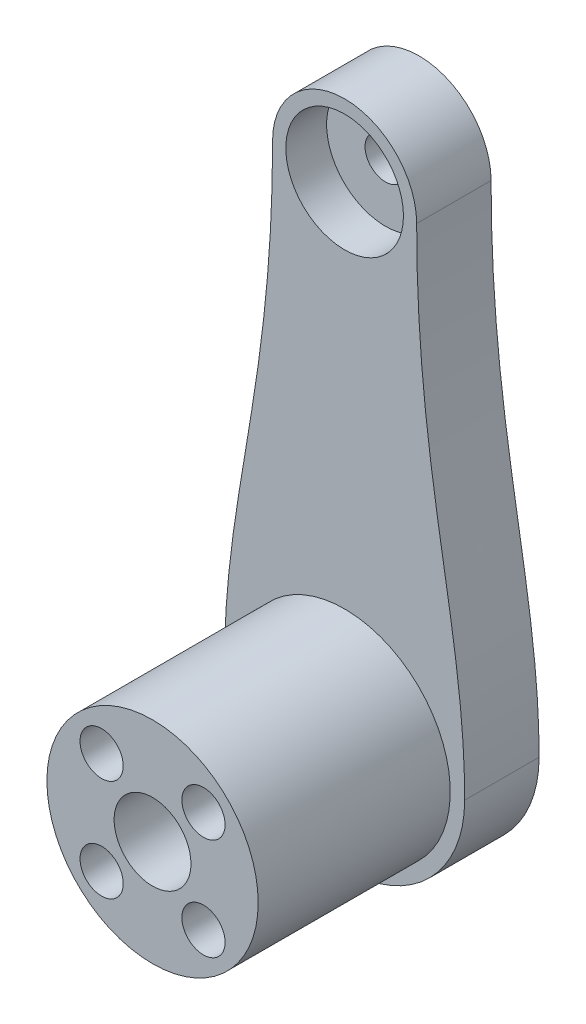
ISO-10303-21;
HEADER;
FILE_DESCRIPTION(('STEP AP214'),'2;1');
FILE_NAME('part.step','',(''),(''),'','','');
FILE_SCHEMA(('AUTOMOTIVE_DESIGN { 1 0 10303 214 1 1 1 1 }'));
ENDSEC;
DATA;
#1=APPLICATION_CONTEXT('core data for automotive mechanical design processes');
#2=APPLICATION_PROTOCOL_DEFINITION('international standard','automotive_design',2000,#1);
#3=PRODUCT_CONTEXT('',#1,'mechanical');
#4=PRODUCT('Part','Part','',(#3));
#5=PRODUCT_RELATED_PRODUCT_CATEGORY('part','',(#4));
#6=PRODUCT_DEFINITION_FORMATION('','',#4);
#7=PRODUCT_DEFINITION_CONTEXT('part definition',#1,'design');
#8=PRODUCT_DEFINITION('design','',#6,#7);
#9=PRODUCT_DEFINITION_SHAPE('','',#8);
#10=(LENGTH_UNIT() NAMED_UNIT(*) SI_UNIT(.MILLI.,.METRE.));
#11=(NAMED_UNIT(*) PLANE_ANGLE_UNIT() SI_UNIT($,.RADIAN.));
#12=(NAMED_UNIT(*) SI_UNIT($,.STERADIAN.) SOLID_ANGLE_UNIT());
#13=UNCERTAINTY_MEASURE_WITH_UNIT(LENGTH_MEASURE(1.E-05),#10,'distance_accuracy_value','');
#14=(GEOMETRIC_REPRESENTATION_CONTEXT(3) GLOBAL_UNCERTAINTY_ASSIGNED_CONTEXT((#13)) GLOBAL_UNIT_ASSIGNED_CONTEXT((#10,
#11,#12)) REPRESENTATION_CONTEXT('',''));
#15=CARTESIAN_POINT('',(0.,0.,0.));
#16=DIRECTION('',(0.,0.,1.));
#17=DIRECTION('',(1.,0.,0.));
#18=AXIS2_PLACEMENT_3D('',#15,#16,#17);
#19=CARTESIAN_POINT('',(0.,0.,27.75));
#20=DIRECTION('',(0.,0.,-1.));
#21=DIRECTION('',(-1.,0.,0.));
#22=AXIS2_PLACEMENT_3D('',#19,#20,#21);
#23=CYLINDRICAL_SURFACE('',#22,2.125);
#24=CARTESIAN_POINT('',(0.,0.,17.75));
#25=DIRECTION('',(0.,0.,1.));
#26=DIRECTION('',(1.,0.,0.));
#27=AXIS2_PLACEMENT_3D('',#24,#25,#26);
#28=CIRCLE('',#27,2.125);
#29=CARTESIAN_POINT('',(2.125,0.,17.75));
#30=VERTEX_POINT('',#29);
#31=EDGE_CURVE('E234',#30,#30,#28,.T.);
#32=ORIENTED_EDGE('',*,*,#31,.T.);
#33=EDGE_LOOP('',(#32));
#34=FACE_BOUND('',#33,.T.);
#35=CARTESIAN_POINT('',(0.,0.,6.));
#36=DIRECTION('',(0.,0.,-1.));
#37=DIRECTION('',(-1.,0.,0.));
#38=AXIS2_PLACEMENT_3D('',#35,#36,#37);
#39=CIRCLE('',#38,2.125);
#40=CARTESIAN_POINT('',(-2.125,0.,6.));
#41=VERTEX_POINT('',#40);
#42=EDGE_CURVE('E40',#41,#41,#39,.F.);
#43=ORIENTED_EDGE('',*,*,#42,.F.);
#44=EDGE_LOOP('',(#43));
#45=FACE_BOUND('',#44,.T.);
#46=ADVANCED_FACE('F35',(#34,#45),#23,.F.);
#47=CARTESIAN_POINT('',(7.5,49.5,7.75));
#48=CARTESIAN_POINT('',(7.5,26.668276539157,7.75));
#49=CARTESIAN_POINT('',(12.5,15.6314619090427,7.75));
#50=CARTESIAN_POINT('',(12.5,0.,7.75));
#51=B_SPLINE_CURVE_WITH_KNOTS('',3,(#47,#48,#49,#50),.UNSPECIFIED.,.F.,.F.,(4,4),(0.,1.),.UNSPECIFIED.);
#52=DIRECTION('',(0.,0.,-1.));
#53=VECTOR('',#52,1.);
#54=SURFACE_OF_LINEAR_EXTRUSION('',#51,#53);
#55=CARTESIAN_POINT('',(7.5,49.5,0.));
#56=CARTESIAN_POINT('',(7.5,26.668276539157,0.));
#57=CARTESIAN_POINT('',(12.5,15.6314619090427,0.));
#58=CARTESIAN_POINT('',(12.5,0.,0.));
#59=B_SPLINE_CURVE_WITH_KNOTS('',3,(#55,#56,#57,#58),.UNSPECIFIED.,.F.,.F.,(4,4),(0.,1.),.UNSPECIFIED.);
#60=CARTESIAN_POINT('',(7.5,49.5,0.));
#61=VERTEX_POINT('',#60);
#62=CARTESIAN_POINT('',(12.5,0.,0.));
#63=VERTEX_POINT('',#62);
#64=EDGE_CURVE('E212',#61,#63,#59,.T.);
#65=ORIENTED_EDGE('',*,*,#64,.F.);
#66=DIRECTION('',(0.,0.,-1.));
#67=VECTOR('',#66,1.);
#68=CARTESIAN_POINT('',(7.5,49.5,7.75));
#69=LINE('',#68,#67);
#70=CARTESIAN_POINT('',(7.5,49.5,7.75));
#71=VERTEX_POINT('',#70);
#72=EDGE_CURVE('E46',#71,#61,#69,.T.);
#73=ORIENTED_EDGE('',*,*,#72,.F.);
#74=CARTESIAN_POINT('',(12.5,0.,7.75));
#75=VERTEX_POINT('',#74);
#76=EDGE_CURVE('E101',#71,#75,#51,.T.);
#77=ORIENTED_EDGE('',*,*,#76,.T.);
#78=DIRECTION('',(0.,0.,-1.));
#79=VECTOR('',#78,1.);
#80=CARTESIAN_POINT('',(12.5,0.,7.75));
#81=LINE('',#80,#79);
#82=EDGE_CURVE('E98',#75,#63,#81,.T.);
#83=ORIENTED_EDGE('',*,*,#82,.T.);
#84=EDGE_LOOP('',(#65,#73,#77,#83));
#85=FACE_BOUND('',#84,.T.);
#86=ADVANCED_FACE('F37',(#85),#54,.T.);
#87=CARTESIAN_POINT('',(0.,49.5,7.75));
#88=DIRECTION('',(0.,0.,-1.));
#89=DIRECTION('',(-1.,0.,0.));
#90=AXIS2_PLACEMENT_3D('',#87,#88,#89);
#91=CYLINDRICAL_SURFACE('',#90,7.5);
#92=CARTESIAN_POINT('',(0.,49.5,0.));
#93=DIRECTION('',(0.,0.,1.));
#94=DIRECTION('',(1.,0.,0.));
#95=AXIS2_PLACEMENT_3D('',#92,#93,#94);
#96=CIRCLE('',#95,7.5);
#97=CARTESIAN_POINT('',(-7.5,49.5,0.));
#98=VERTEX_POINT('',#97);
#99=EDGE_CURVE('E71',#61,#98,#96,.T.);
#100=ORIENTED_EDGE('',*,*,#99,.T.);
#101=DIRECTION('',(0.,0.,-1.));
#102=VECTOR('',#101,1.);
#103=CARTESIAN_POINT('',(-7.5,49.5,7.75));
#104=LINE('',#103,#102);
#105=CARTESIAN_POINT('',(-7.5,49.5,7.75));
#106=VERTEX_POINT('',#105);
#107=EDGE_CURVE('E97',#106,#98,#104,.T.);
#108=ORIENTED_EDGE('',*,*,#107,.F.);
#109=CARTESIAN_POINT('',(0.,49.5,7.75));
#110=DIRECTION('',(0.,0.,1.));
#111=DIRECTION('',(1.,0.,0.));
#112=AXIS2_PLACEMENT_3D('',#109,#110,#111);
#113=CIRCLE('',#112,7.5);
#114=EDGE_CURVE('E86',#71,#106,#113,.T.);
#115=ORIENTED_EDGE('',*,*,#114,.F.);
#116=ORIENTED_EDGE('',*,*,#72,.T.);
#117=EDGE_LOOP('',(#100,#108,#115,#116));
#118=FACE_BOUND('',#117,.T.);
#119=ADVANCED_FACE('F118',(#118),#91,.T.);
#120=CARTESIAN_POINT('',(-7.5,49.5,7.75));
#121=CARTESIAN_POINT('',(-7.5,26.668276539157,7.75));
#122=CARTESIAN_POINT('',(-12.5,15.6314619090427,7.75));
#123=CARTESIAN_POINT('',(-12.5,0.,7.75));
#124=B_SPLINE_CURVE_WITH_KNOTS('',3,(#120,#121,#122,#123),.UNSPECIFIED.,.F.,.F.,(4,4),(0.,1.),.UNSPECIFIED.);
#125=DIRECTION('',(0.,0.,-1.));
#126=VECTOR('',#125,1.);
#127=SURFACE_OF_LINEAR_EXTRUSION('',#124,#126);
#128=CARTESIAN_POINT('',(-7.5,49.5,0.));
#129=CARTESIAN_POINT('',(-7.5,26.668276539157,0.));
#130=CARTESIAN_POINT('',(-12.5,15.6314619090427,0.));
#131=CARTESIAN_POINT('',(-12.5,0.,0.));
#132=B_SPLINE_CURVE_WITH_KNOTS('',3,(#128,#129,#130,#131),.UNSPECIFIED.,.F.,.F.,(4,4),(0.,1.),.UNSPECIFIED.);
#133=CARTESIAN_POINT('',(-12.5,0.,0.));
#134=VERTEX_POINT('',#133);
#135=EDGE_CURVE('E93',#98,#134,#132,.T.);
#136=ORIENTED_EDGE('',*,*,#135,.T.);
#137=DIRECTION('',(0.,0.,-1.));
#138=VECTOR('',#137,1.);
#139=CARTESIAN_POINT('',(-12.5,0.,7.75));
#140=LINE('',#139,#138);
#141=CARTESIAN_POINT('',(-12.5,0.,7.75));
#142=VERTEX_POINT('',#141);
#143=EDGE_CURVE('E90',#142,#134,#140,.T.);
#144=ORIENTED_EDGE('',*,*,#143,.F.);
#145=EDGE_CURVE('E83',#106,#142,#124,.T.);
#146=ORIENTED_EDGE('',*,*,#145,.F.);
#147=ORIENTED_EDGE('',*,*,#107,.T.);
#148=EDGE_LOOP('',(#136,#144,#146,#147));
#149=FACE_BOUND('',#148,.T.);
#150=ADVANCED_FACE('F91',(#149),#127,.F.);
#151=CARTESIAN_POINT('',(0.,0.,7.75));
#152=DIRECTION('',(0.,0.,-1.));
#153=DIRECTION('',(-1.,0.,0.));
#154=AXIS2_PLACEMENT_3D('',#151,#152,#153);
#155=CYLINDRICAL_SURFACE('',#154,12.5);
#156=CARTESIAN_POINT('',(0.,0.,0.));
#157=DIRECTION('',(0.,0.,1.));
#158=DIRECTION('',(1.,0.,0.));
#159=AXIS2_PLACEMENT_3D('',#156,#157,#158);
#160=CIRCLE('',#159,12.5);
#161=EDGE_CURVE('E213',#134,#63,#160,.T.);
#162=ORIENTED_EDGE('',*,*,#161,.T.);
#163=ORIENTED_EDGE('',*,*,#82,.F.);
#164=CARTESIAN_POINT('',(0.,0.,7.75));
#165=DIRECTION('',(0.,0.,1.));
#166=DIRECTION('',(1.,0.,0.));
#167=AXIS2_PLACEMENT_3D('',#164,#165,#166);
#168=CIRCLE('',#167,12.5);
#169=EDGE_CURVE('E80',#142,#75,#168,.T.);
#170=ORIENTED_EDGE('',*,*,#169,.F.);
#171=ORIENTED_EDGE('',*,*,#143,.T.);
#172=EDGE_LOOP('',(#162,#163,#170,#171));
#173=FACE_BOUND('',#172,.T.);
#174=ADVANCED_FACE('F100',(#173),#155,.T.);
#175=CARTESIAN_POINT('',(10.,22.0499019180749,7.75));
#176=DIRECTION('',(0.,0.,-1.));
#177=DIRECTION('',(-1.,0.,0.));
#178=AXIS2_PLACEMENT_3D('',#175,#176,#177);
#179=PLANE('',#178);
#180=CARTESIAN_POINT('',(0.,0.,7.75));
#181=DIRECTION('',(0.,0.,-1.));
#182=DIRECTION('',(-1.,0.,0.));
#183=AXIS2_PLACEMENT_3D('',#180,#181,#182);
#184=CIRCLE('',#183,11.);
#185=CARTESIAN_POINT('',(-11.,0.,7.75));
#186=VERTEX_POINT('',#185);
#187=EDGE_CURVE('E11',#186,#186,#184,.F.);
#188=ORIENTED_EDGE('',*,*,#187,.F.);
#189=EDGE_LOOP('',(#188));
#190=FACE_BOUND('',#189,.T.);
#191=CARTESIAN_POINT('',(0.,49.5,7.75));
#192=DIRECTION('',(0.,0.,1.));
#193=DIRECTION('',(1.,0.,0.));
#194=AXIS2_PLACEMENT_3D('',#191,#192,#193);
#195=CIRCLE('',#194,6.125);
#196=CARTESIAN_POINT('',(6.125,49.5,7.75));
#197=VERTEX_POINT('',#196);
#198=EDGE_CURVE('E217',#197,#197,#195,.T.);
#199=ORIENTED_EDGE('',*,*,#198,.F.);
#200=EDGE_LOOP('',(#199));
#201=FACE_BOUND('',#200,.T.);
#202=ORIENTED_EDGE('',*,*,#76,.F.);
#203=ORIENTED_EDGE('',*,*,#114,.T.);
#204=ORIENTED_EDGE('',*,*,#145,.T.);
#205=ORIENTED_EDGE('',*,*,#169,.T.);
#206=EDGE_LOOP('',(#202,#203,#204,#205));
#207=FACE_BOUND('',#206,.T.);
#208=ADVANCED_FACE('F85',(#190,#201,#207),#179,.F.);
#209=CARTESIAN_POINT('',(10.,22.0499019180749,0.));
#210=DIRECTION('',(0.,0.,-1.));
#211=DIRECTION('',(-1.,0.,0.));
#212=AXIS2_PLACEMENT_3D('',#209,#210,#211);
#213=PLANE('',#212);
#214=CARTESIAN_POINT('',(0.,0.,0.));
#215=DIRECTION('',(0.,0.,-1.));
#216=DIRECTION('',(-1.,0.,0.));
#217=AXIS2_PLACEMENT_3D('',#214,#215,#216);
#218=CIRCLE('',#217,2.75);
#219=CARTESIAN_POINT('',(-2.75,0.,0.));
#220=VERTEX_POINT('',#219);
#221=EDGE_CURVE('E206',#220,#220,#218,.T.);
#222=ORIENTED_EDGE('',*,*,#221,.F.);
#223=EDGE_LOOP('',(#222));
#224=FACE_BOUND('',#223,.T.);
#225=CARTESIAN_POINT('',(0.,49.5,0.));
#226=DIRECTION('',(0.,0.,-1.));
#227=DIRECTION('',(-1.,0.,0.));
#228=AXIS2_PLACEMENT_3D('',#225,#226,#227);
#229=CIRCLE('',#228,2.125);
#230=CARTESIAN_POINT('',(-2.125,49.5,0.));
#231=VERTEX_POINT('',#230);
#232=EDGE_CURVE('E210',#231,#231,#229,.F.);
#233=ORIENTED_EDGE('',*,*,#232,.T.);
#234=EDGE_LOOP('',(#233));
#235=FACE_BOUND('',#234,.T.);
#236=ORIENTED_EDGE('',*,*,#64,.T.);
#237=ORIENTED_EDGE('',*,*,#161,.F.);
#238=ORIENTED_EDGE('',*,*,#135,.F.);
#239=ORIENTED_EDGE('',*,*,#99,.F.);
#240=EDGE_LOOP('',(#236,#237,#238,#239));
#241=FACE_BOUND('',#240,.T.);
#242=ADVANCED_FACE('F124',(#224,#235,#241),#213,.T.);
#243=CARTESIAN_POINT('',(0.,49.5,3.5));
#244=DIRECTION('',(0.,0.,1.));
#245=DIRECTION('',(1.,0.,0.));
#246=AXIS2_PLACEMENT_3D('',#243,#244,#245);
#247=CYLINDRICAL_SURFACE('',#246,6.125);
#248=CARTESIAN_POINT('',(0.,49.5,3.5));
#249=DIRECTION('',(0.,0.,1.));
#250=DIRECTION('',(1.,0.,0.));
#251=AXIS2_PLACEMENT_3D('',#248,#249,#250);
#252=CIRCLE('',#251,6.125);
#253=CARTESIAN_POINT('',(6.125,49.5,3.5));
#254=VERTEX_POINT('',#253);
#255=EDGE_CURVE('E214',#254,#254,#252,.T.);
#256=ORIENTED_EDGE('',*,*,#255,.F.);
#257=EDGE_LOOP('',(#256));
#258=FACE_BOUND('',#257,.T.);
#259=ORIENTED_EDGE('',*,*,#198,.T.);
#260=EDGE_LOOP('',(#259));
#261=FACE_BOUND('',#260,.T.);
#262=ADVANCED_FACE('F195',(#258,#261),#247,.F.);
#263=CARTESIAN_POINT('',(0.,49.5,3.5));
#264=DIRECTION('',(0.,0.,1.));
#265=DIRECTION('',(1.,0.,0.));
#266=AXIS2_PLACEMENT_3D('',#263,#264,#265);
#267=PLANE('',#266);
#268=CARTESIAN_POINT('',(0.,49.5,3.5));
#269=DIRECTION('',(0.,0.,1.));
#270=DIRECTION('',(1.,0.,0.));
#271=AXIS2_PLACEMENT_3D('',#268,#269,#270);
#272=CIRCLE('',#271,2.125);
#273=CARTESIAN_POINT('',(2.125,49.5,3.5));
#274=VERTEX_POINT('',#273);
#275=EDGE_CURVE('E279',#274,#274,#272,.T.);
#276=ORIENTED_EDGE('',*,*,#275,.F.);
#277=EDGE_LOOP('',(#276));
#278=FACE_BOUND('',#277,.T.);
#279=ORIENTED_EDGE('',*,*,#255,.T.);
#280=EDGE_LOOP('',(#279));
#281=FACE_BOUND('',#280,.T.);
#282=ADVANCED_FACE('F191',(#278,#281),#267,.T.);
#283=CARTESIAN_POINT('',(0.,49.5,-0.00100000000000013));
#284=DIRECTION('',(0.,0.,1.));
#285=DIRECTION('',(1.,0.,0.));
#286=AXIS2_PLACEMENT_3D('',#283,#284,#285);
#287=CYLINDRICAL_SURFACE('',#286,2.125);
#288=ORIENTED_EDGE('',*,*,#232,.F.);
#289=EDGE_LOOP('',(#288));
#290=FACE_BOUND('',#289,.T.);
#291=ORIENTED_EDGE('',*,*,#275,.T.);
#292=EDGE_LOOP('',(#291));
#293=FACE_BOUND('',#292,.T.);
#294=ADVANCED_FACE('F187',(#290,#293),#287,.F.);
#295=CARTESIAN_POINT('',(0.,0.,27.75));
#296=DIRECTION('',(0.,0.,-1.));
#297=DIRECTION('',(-1.,0.,0.));
#298=AXIS2_PLACEMENT_3D('',#295,#296,#297);
#299=CYLINDRICAL_SURFACE('',#298,11.);
#300=CARTESIAN_POINT('',(0.,0.,27.75));
#301=DIRECTION('',(0.,0.,1.));
#302=DIRECTION('',(1.,0.,0.));
#303=AXIS2_PLACEMENT_3D('',#300,#301,#302);
#304=CIRCLE('',#303,11.);
#305=CARTESIAN_POINT('',(11.,0.,27.75));
#306=VERTEX_POINT('',#305);
#307=EDGE_CURVE('E274',#306,#306,#304,.T.);
#308=ORIENTED_EDGE('',*,*,#307,.F.);
#309=EDGE_LOOP('',(#308));
#310=FACE_BOUND('',#309,.T.);
#311=ORIENTED_EDGE('',*,*,#187,.T.);
#312=EDGE_LOOP('',(#311));
#313=FACE_BOUND('',#312,.T.);
#314=ADVANCED_FACE('F183',(#310,#313),#299,.T.);
#315=CARTESIAN_POINT('',(0.,0.,27.75));
#316=DIRECTION('',(0.,0.,1.));
#317=DIRECTION('',(1.,0.,0.));
#318=AXIS2_PLACEMENT_3D('',#315,#316,#317);
#319=PLANE('',#318);
#320=CARTESIAN_POINT('',(-5.30330085889911,5.30330085889881,27.75));
#321=DIRECTION('',(0.,0.,1.));
#322=DIRECTION('',(1.,0.,0.));
#323=AXIS2_PLACEMENT_3D('',#320,#321,#322);
#324=CIRCLE('',#323,2.25000000000032);
#325=CARTESIAN_POINT('',(-3.05330085889879,5.30330085889881,27.75));
#326=VERTEX_POINT('',#325);
#327=EDGE_CURVE('E235',#326,#326,#324,.T.);
#328=ORIENTED_EDGE('',*,*,#327,.F.);
#329=EDGE_LOOP('',(#328));
#330=FACE_BOUND('',#329,.T.);
#331=CARTESIAN_POINT('',(-5.30330085889881,-5.3033008588994,27.75));
#332=DIRECTION('',(0.,0.,1.));
#333=DIRECTION('',(1.,0.,0.));
#334=AXIS2_PLACEMENT_3D('',#331,#332,#333);
#335=CIRCLE('',#334,2.25000000000022);
#336=CARTESIAN_POINT('',(-3.05330085889859,-5.3033008588994,27.75));
#337=VERTEX_POINT('',#336);
#338=EDGE_CURVE('E266',#337,#337,#335,.T.);
#339=ORIENTED_EDGE('',*,*,#338,.F.);
#340=EDGE_LOOP('',(#339));
#341=FACE_BOUND('',#340,.T.);
#342=CARTESIAN_POINT('',(5.3033008588994,-5.3033008588991,27.75));
#343=DIRECTION('',(0.,0.,1.));
#344=DIRECTION('',(1.,0.,0.));
#345=AXIS2_PLACEMENT_3D('',#342,#343,#344);
#346=CIRCLE('',#345,2.24999999999993);
#347=CARTESIAN_POINT('',(7.55330085889933,-5.3033008588991,27.75));
#348=VERTEX_POINT('',#347);
#349=EDGE_CURVE('E260',#348,#348,#346,.T.);
#350=ORIENTED_EDGE('',*,*,#349,.F.);
#351=EDGE_LOOP('',(#350));
#352=FACE_BOUND('',#351,.T.);
#353=CARTESIAN_POINT('',(5.30330085889911,5.30330085889911,27.75));
#354=DIRECTION('',(0.,0.,1.));
#355=DIRECTION('',(1.,0.,0.));
#356=AXIS2_PLACEMENT_3D('',#353,#354,#355);
#357=CIRCLE('',#356,2.25);
#358=CARTESIAN_POINT('',(7.5533008588991,5.30330085889911,27.75));
#359=VERTEX_POINT('',#358);
#360=EDGE_CURVE('E254',#359,#359,#357,.T.);
#361=ORIENTED_EDGE('',*,*,#360,.F.);
#362=EDGE_LOOP('',(#361));
#363=FACE_BOUND('',#362,.T.);
#364=CARTESIAN_POINT('',(0.,0.,27.75));
#365=DIRECTION('',(0.,0.,1.));
#366=DIRECTION('',(1.,0.,0.));
#367=AXIS2_PLACEMENT_3D('',#364,#365,#366);
#368=CIRCLE('',#367,4.);
#369=CARTESIAN_POINT('',(4.,0.,27.75));
#370=VERTEX_POINT('',#369);
#371=EDGE_CURVE('E253',#370,#370,#368,.T.);
#372=ORIENTED_EDGE('',*,*,#371,.F.);
#373=EDGE_LOOP('',(#372));
#374=FACE_BOUND('',#373,.T.);
#375=ORIENTED_EDGE('',*,*,#307,.T.);
#376=EDGE_LOOP('',(#375));
#377=FACE_BOUND('',#376,.T.);
#378=ADVANCED_FACE('F179',(#330,#341,#352,#363,#374,#377),#319,.T.);
#379=CARTESIAN_POINT('',(0.,0.,17.75));
#380=DIRECTION('',(0.,0.,1.));
#381=DIRECTION('',(1.,0.,0.));
#382=AXIS2_PLACEMENT_3D('',#379,#380,#381);
#383=CYLINDRICAL_SURFACE('',#382,4.);
#384=CARTESIAN_POINT('',(0.,0.,17.75));
#385=DIRECTION('',(0.,0.,1.));
#386=DIRECTION('',(1.,0.,0.));
#387=AXIS2_PLACEMENT_3D('',#384,#385,#386);
#388=CIRCLE('',#387,4.);
#389=CARTESIAN_POINT('',(4.,0.,17.75));
#390=VERTEX_POINT('',#389);
#391=EDGE_CURVE('E271',#390,#390,#388,.T.);
#392=ORIENTED_EDGE('',*,*,#391,.F.);
#393=EDGE_LOOP('',(#392));
#394=FACE_BOUND('',#393,.T.);
#395=ORIENTED_EDGE('',*,*,#371,.T.);
#396=EDGE_LOOP('',(#395));
#397=FACE_BOUND('',#396,.T.);
#398=ADVANCED_FACE('F175',(#394,#397),#383,.F.);
#399=CARTESIAN_POINT('',(0.,0.,17.75));
#400=DIRECTION('',(0.,0.,1.));
#401=DIRECTION('',(1.,0.,0.));
#402=AXIS2_PLACEMENT_3D('',#399,#400,#401);
#403=PLANE('',#402);
#404=ORIENTED_EDGE('',*,*,#31,.F.);
#405=EDGE_LOOP('',(#404));
#406=FACE_BOUND('',#405,.T.);
#407=ORIENTED_EDGE('',*,*,#391,.T.);
#408=EDGE_LOOP('',(#407));
#409=FACE_BOUND('',#408,.T.);
#410=ADVANCED_FACE('F147',(#406,#409),#403,.T.);
#411=CARTESIAN_POINT('',(5.30330085889911,5.30330085889911,17.75));
#412=DIRECTION('',(0.,0.,1.));
#413=DIRECTION('',(1.,0.,0.));
#414=AXIS2_PLACEMENT_3D('',#411,#412,#413);
#415=CYLINDRICAL_SURFACE('',#414,2.25);
#416=CARTESIAN_POINT('',(5.30330085889911,5.30330085889911,17.75));
#417=DIRECTION('',(0.,0.,1.));
#418=DIRECTION('',(1.,0.,0.));
#419=AXIS2_PLACEMENT_3D('',#416,#417,#418);
#420=CIRCLE('',#419,2.25);
#421=CARTESIAN_POINT('',(7.5533008588991,5.30330085889911,17.75));
#422=VERTEX_POINT('',#421);
#423=EDGE_CURVE('E250',#422,#422,#420,.T.);
#424=ORIENTED_EDGE('',*,*,#423,.F.);
#425=EDGE_LOOP('',(#424));
#426=FACE_BOUND('',#425,.T.);
#427=ORIENTED_EDGE('',*,*,#360,.T.);
#428=EDGE_LOOP('',(#427));
#429=FACE_BOUND('',#428,.T.);
#430=ADVANCED_FACE('F143',(#426,#429),#415,.F.);
#431=CARTESIAN_POINT('',(5.30330085889911,5.30330085889911,17.75));
#432=DIRECTION('',(0.,0.,1.));
#433=DIRECTION('',(1.,0.,0.));
#434=AXIS2_PLACEMENT_3D('',#431,#432,#433);
#435=PLANE('',#434);
#436=ORIENTED_EDGE('',*,*,#423,.T.);
#437=EDGE_LOOP('',(#436));
#438=FACE_BOUND('',#437,.T.);
#439=ADVANCED_FACE('F139',(#438),#435,.T.);
#440=CARTESIAN_POINT('',(5.3033008588994,-5.3033008588991,17.75));
#441=DIRECTION('',(0.,0.,1.));
#442=DIRECTION('',(1.,0.,0.));
#443=AXIS2_PLACEMENT_3D('',#440,#441,#442);
#444=CYLINDRICAL_SURFACE('',#443,2.24999999999993);
#445=CARTESIAN_POINT('',(5.3033008588994,-5.3033008588991,17.75));
#446=DIRECTION('',(0.,0.,1.));
#447=DIRECTION('',(1.,0.,0.));
#448=AXIS2_PLACEMENT_3D('',#445,#446,#447);
#449=CIRCLE('',#448,2.24999999999993);
#450=CARTESIAN_POINT('',(7.55330085889933,-5.3033008588991,17.75));
#451=VERTEX_POINT('',#450);
#452=EDGE_CURVE('E257',#451,#451,#449,.T.);
#453=ORIENTED_EDGE('',*,*,#452,.F.);
#454=EDGE_LOOP('',(#453));
#455=FACE_BOUND('',#454,.T.);
#456=ORIENTED_EDGE('',*,*,#349,.T.);
#457=EDGE_LOOP('',(#456));
#458=FACE_BOUND('',#457,.T.);
#459=ADVANCED_FACE('F142',(#455,#458),#444,.F.);
#460=CARTESIAN_POINT('',(5.3033008588994,-5.3033008588991,17.75));
#461=DIRECTION('',(0.,0.,1.));
#462=DIRECTION('',(1.,0.,0.));
#463=AXIS2_PLACEMENT_3D('',#460,#461,#462);
#464=PLANE('',#463);
#465=ORIENTED_EDGE('',*,*,#452,.T.);
#466=EDGE_LOOP('',(#465));
#467=FACE_BOUND('',#466,.T.);
#468=ADVANCED_FACE('F149',(#467),#464,.T.);
#469=CARTESIAN_POINT('',(-5.30330085889881,-5.3033008588994,17.75));
#470=DIRECTION('',(0.,0.,1.));
#471=DIRECTION('',(1.,0.,0.));
#472=AXIS2_PLACEMENT_3D('',#469,#470,#471);
#473=CYLINDRICAL_SURFACE('',#472,2.25000000000022);
#474=CARTESIAN_POINT('',(-5.30330085889881,-5.3033008588994,17.75));
#475=DIRECTION('',(0.,0.,1.));
#476=DIRECTION('',(1.,0.,0.));
#477=AXIS2_PLACEMENT_3D('',#474,#475,#476);
#478=CIRCLE('',#477,2.25000000000022);
#479=CARTESIAN_POINT('',(-3.05330085889859,-5.3033008588994,17.75));
#480=VERTEX_POINT('',#479);
#481=EDGE_CURVE('E263',#480,#480,#478,.T.);
#482=ORIENTED_EDGE('',*,*,#481,.F.);
#483=EDGE_LOOP('',(#482));
#484=FACE_BOUND('',#483,.T.);
#485=ORIENTED_EDGE('',*,*,#338,.T.);
#486=EDGE_LOOP('',(#485));
#487=FACE_BOUND('',#486,.T.);
#488=ADVANCED_FACE('F152',(#484,#487),#473,.F.);
#489=CARTESIAN_POINT('',(-5.30330085889881,-5.3033008588994,17.75));
#490=DIRECTION('',(0.,0.,1.));
#491=DIRECTION('',(1.,0.,0.));
#492=AXIS2_PLACEMENT_3D('',#489,#490,#491);
#493=PLANE('',#492);
#494=ORIENTED_EDGE('',*,*,#481,.T.);
#495=EDGE_LOOP('',(#494));
#496=FACE_BOUND('',#495,.T.);
#497=ADVANCED_FACE('F157',(#496),#493,.T.);
#498=CARTESIAN_POINT('',(-5.30330085889911,5.30330085889881,17.75));
#499=DIRECTION('',(0.,0.,1.));
#500=DIRECTION('',(1.,0.,0.));
#501=AXIS2_PLACEMENT_3D('',#498,#499,#500);
#502=CYLINDRICAL_SURFACE('',#501,2.25000000000032);
#503=CARTESIAN_POINT('',(-5.30330085889911,5.30330085889881,17.75));
#504=DIRECTION('',(0.,0.,1.));
#505=DIRECTION('',(1.,0.,0.));
#506=AXIS2_PLACEMENT_3D('',#503,#504,#505);
#507=CIRCLE('',#506,2.25000000000032);
#508=CARTESIAN_POINT('',(-3.05330085889879,5.30330085889881,17.75));
#509=VERTEX_POINT('',#508);
#510=EDGE_CURVE('E238',#509,#509,#507,.T.);
#511=ORIENTED_EDGE('',*,*,#510,.F.);
#512=EDGE_LOOP('',(#511));
#513=FACE_BOUND('',#512,.T.);
#514=ORIENTED_EDGE('',*,*,#327,.T.);
#515=EDGE_LOOP('',(#514));
#516=FACE_BOUND('',#515,.T.);
#517=ADVANCED_FACE('F160',(#513,#516),#502,.F.);
#518=CARTESIAN_POINT('',(-5.30330085889911,5.30330085889881,17.75));
#519=DIRECTION('',(0.,0.,1.));
#520=DIRECTION('',(1.,0.,0.));
#521=AXIS2_PLACEMENT_3D('',#518,#519,#520);
#522=PLANE('',#521);
#523=ORIENTED_EDGE('',*,*,#510,.T.);
#524=EDGE_LOOP('',(#523));
#525=FACE_BOUND('',#524,.T.);
#526=ADVANCED_FACE('F165',(#525),#522,.T.);
#527=CARTESIAN_POINT('',(0.,0.,6.));
#528=DIRECTION('',(0.,0.,-1.));
#529=DIRECTION('',(-1.,0.,0.));
#530=AXIS2_PLACEMENT_3D('',#527,#528,#529);
#531=PLANE('',#530);
#532=CARTESIAN_POINT('',(0.,0.,6.));
#533=DIRECTION('',(0.,0.,-1.));
#534=DIRECTION('',(-1.,0.,0.));
#535=AXIS2_PLACEMENT_3D('',#532,#533,#534);
#536=CIRCLE('',#535,2.75);
#537=CARTESIAN_POINT('',(-2.75,0.,6.));
#538=VERTEX_POINT('',#537);
#539=EDGE_CURVE('E241',#538,#538,#536,.T.);
#540=ORIENTED_EDGE('',*,*,#539,.T.);
#541=EDGE_LOOP('',(#540));
#542=FACE_BOUND('',#541,.T.);
#543=ORIENTED_EDGE('',*,*,#42,.T.);
#544=EDGE_LOOP('',(#543));
#545=FACE_BOUND('',#544,.T.);
#546=ADVANCED_FACE('F168',(#542,#545),#531,.T.);
#547=CARTESIAN_POINT('',(0.,0.,6.));
#548=DIRECTION('',(0.,0.,-1.));
#549=DIRECTION('',(-1.,0.,0.));
#550=AXIS2_PLACEMENT_3D('',#547,#548,#549);
#551=CYLINDRICAL_SURFACE('',#550,2.75);
#552=ORIENTED_EDGE('',*,*,#539,.F.);
#553=EDGE_LOOP('',(#552));
#554=FACE_BOUND('',#553,.T.);
#555=ORIENTED_EDGE('',*,*,#221,.T.);
#556=EDGE_LOOP('',(#555));
#557=FACE_BOUND('',#556,.T.);
#558=ADVANCED_FACE('F137',(#554,#557),#551,.F.);
#559=CLOSED_SHELL('',(#46,#86,#119,#150,#174,#208,#242,#262,#282,#294,#314,#378,#398,#410,#430,
#439,#459,#468,#488,#497,#517,#526,#546,#558));
#560=MANIFOLD_SOLID_BREP('B2',#559);
#561=ADVANCED_BREP_SHAPE_REPRESENTATION('',(#18,#560),#14);
#562=SHAPE_DEFINITION_REPRESENTATION(#9,#561);
ENDSEC;
END-ISO-10303-21;
